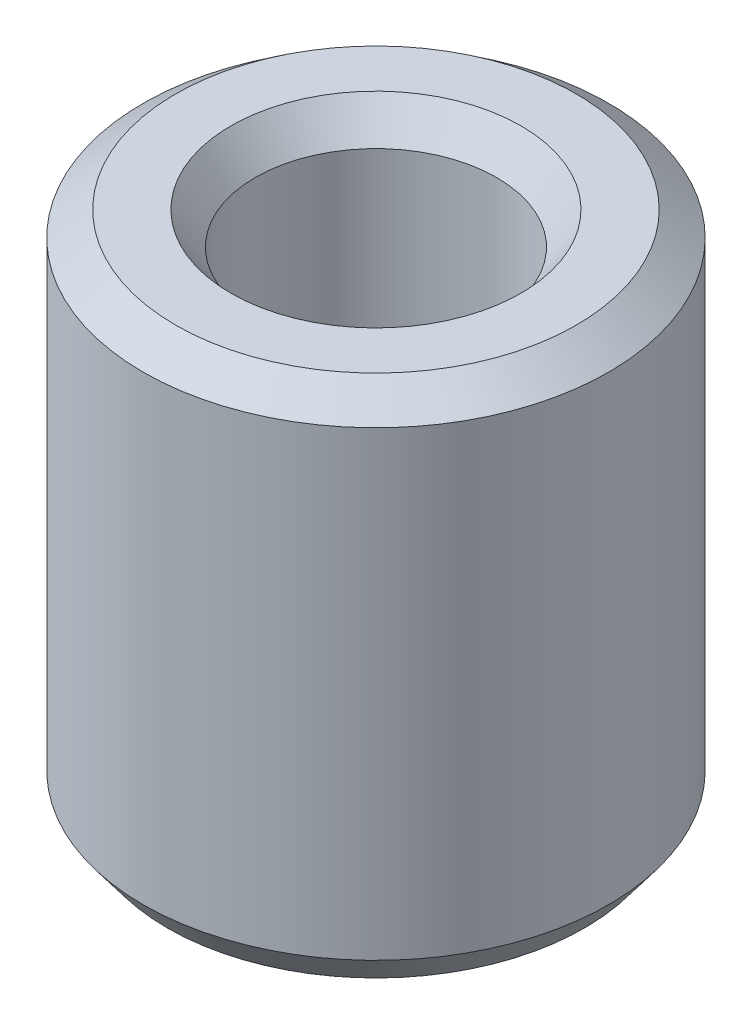
ISO-10303-21;
HEADER;
FILE_DESCRIPTION(('STEP AP214'),'2;1');
FILE_NAME('part.step','',(''),(''),'','','');
FILE_SCHEMA(('AUTOMOTIVE_DESIGN { 1 0 10303 214 1 1 1 1 }'));
ENDSEC;
DATA;
#1=APPLICATION_CONTEXT('core data for automotive mechanical design processes');
#2=APPLICATION_PROTOCOL_DEFINITION('international standard','automotive_design',2000,#1);
#3=PRODUCT_CONTEXT('',#1,'mechanical');
#4=PRODUCT('Part','Part','',(#3));
#5=PRODUCT_RELATED_PRODUCT_CATEGORY('part','',(#4));
#6=PRODUCT_DEFINITION_FORMATION('','',#4);
#7=PRODUCT_DEFINITION_CONTEXT('part definition',#1,'design');
#8=PRODUCT_DEFINITION('design','',#6,#7);
#9=PRODUCT_DEFINITION_SHAPE('','',#8);
#10=(LENGTH_UNIT() NAMED_UNIT(*) SI_UNIT(.MILLI.,.METRE.));
#11=(NAMED_UNIT(*) PLANE_ANGLE_UNIT() SI_UNIT($,.RADIAN.));
#12=(NAMED_UNIT(*) SI_UNIT($,.STERADIAN.) SOLID_ANGLE_UNIT());
#13=UNCERTAINTY_MEASURE_WITH_UNIT(LENGTH_MEASURE(1.E-05),#10,'distance_accuracy_value','');
#14=(GEOMETRIC_REPRESENTATION_CONTEXT(3) GLOBAL_UNCERTAINTY_ASSIGNED_CONTEXT((#13)) GLOBAL_UNIT_ASSIGNED_CONTEXT((#10,
#11,#12)) REPRESENTATION_CONTEXT('',''));
#15=CARTESIAN_POINT('',(0.,0.,0.));
#16=DIRECTION('',(0.,0.,1.));
#17=DIRECTION('',(1.,0.,0.));
#18=AXIS2_PLACEMENT_3D('',#15,#16,#17);
#19=CARTESIAN_POINT('',(0.,11.1277565931135,0.));
#20=DIRECTION('',(0.,-1.,0.));
#21=DIRECTION('',(0.,0.,-1.));
#22=AXIS2_PLACEMENT_3D('',#19,#20,#21);
#23=CYLINDRICAL_SURFACE('',#22,5.);
#24=CARTESIAN_POINT('',(0.,0.698186209261358,0.));
#25=DIRECTION('',(0.,1.,0.));
#26=DIRECTION('',(0.,0.,1.));
#27=AXIS2_PLACEMENT_3D('',#24,#25,#26);
#28=CIRCLE('',#27,5.);
#29=CARTESIAN_POINT('',(0.,0.698186209261358,5.));
#30=VERTEX_POINT('',#29);
#31=EDGE_CURVE('E10',#30,#30,#28,.T.);
#32=ORIENTED_EDGE('',*,*,#31,.T.);
#33=EDGE_LOOP('',(#32));
#34=FACE_BOUND('',#33,.T.);
#35=CARTESIAN_POINT('',(0.,10.6038862192034,0.));
#36=DIRECTION('',(0.,1.,0.));
#37=DIRECTION('',(0.,0.,1.));
#38=AXIS2_PLACEMENT_3D('',#35,#36,#37);
#39=CIRCLE('',#38,5.);
#40=CARTESIAN_POINT('',(0.,10.6038862192034,5.));
#41=VERTEX_POINT('',#40);
#42=EDGE_CURVE('E50',#41,#41,#39,.F.);
#43=ORIENTED_EDGE('',*,*,#42,.T.);
#44=EDGE_LOOP('',(#43));
#45=FACE_BOUND('',#44,.T.);
#46=ADVANCED_FACE('F39',(#34,#45),#23,.T.);
#47=CARTESIAN_POINT('',(0.,11.1277565931135,0.));
#48=DIRECTION('',(0.,1.,0.));
#49=DIRECTION('',(0.,0.,1.));
#50=AXIS2_PLACEMENT_3D('',#47,#48,#49);
#51=PLANE('',#50);
#52=CARTESIAN_POINT('',(0.,11.1277565931135,0.));
#53=DIRECTION('',(0.,1.,0.));
#54=DIRECTION('',(0.,0.,1.));
#55=AXIS2_PLACEMENT_3D('',#52,#53,#54);
#56=CIRCLE('',#55,3.11444026431996);
#57=CARTESIAN_POINT('',(0.,11.1277565931135,3.11444026431996));
#58=VERTEX_POINT('',#57);
#59=EDGE_CURVE('E58',#58,#58,#56,.F.);
#60=ORIENTED_EDGE('',*,*,#59,.T.);
#61=EDGE_LOOP('',(#60));
#62=FACE_BOUND('',#61,.T.);
#63=CARTESIAN_POINT('',(0.,11.1277565931135,0.));
#64=DIRECTION('',(0.,1.,0.));
#65=DIRECTION('',(0.,0.,1.));
#66=AXIS2_PLACEMENT_3D('',#63,#64,#65);
#67=CIRCLE('',#66,4.30181379073864);
#68=CARTESIAN_POINT('',(0.,11.1277565931135,4.30181379073864));
#69=VERTEX_POINT('',#68);
#70=EDGE_CURVE('E61',#69,#69,#67,.T.);
#71=ORIENTED_EDGE('',*,*,#70,.T.);
#72=EDGE_LOOP('',(#71));
#73=FACE_BOUND('',#72,.T.);
#74=ADVANCED_FACE('F88',(#62,#73),#51,.T.);
#75=CARTESIAN_POINT('',(0.,0.,0.));
#76=DIRECTION('',(0.,1.,0.));
#77=DIRECTION('',(0.,0.,1.));
#78=AXIS2_PLACEMENT_3D('',#75,#76,#77);
#79=PLANE('',#78);
#80=CARTESIAN_POINT('',(0.,0.,0.));
#81=DIRECTION('',(0.,1.,0.));
#82=DIRECTION('',(0.,0.,1.));
#83=AXIS2_PLACEMENT_3D('',#80,#81,#82);
#84=CIRCLE('',#83,3.28875609967118);
#85=CARTESIAN_POINT('',(0.,0.,3.28875609967118));
#86=VERTEX_POINT('',#85);
#87=EDGE_CURVE('E51',#86,#86,#84,.T.);
#88=ORIENTED_EDGE('',*,*,#87,.T.);
#89=EDGE_LOOP('',(#88));
#90=FACE_BOUND('',#89,.T.);
#91=CARTESIAN_POINT('',(0.,0.,0.));
#92=DIRECTION('',(0.,1.,0.));
#93=DIRECTION('',(0.,0.,1.));
#94=AXIS2_PLACEMENT_3D('',#91,#92,#93);
#95=CIRCLE('',#94,4.47612962608987);
#96=CARTESIAN_POINT('',(0.,0.,4.47612962608987));
#97=VERTEX_POINT('',#96);
#98=EDGE_CURVE('E54',#97,#97,#95,.F.);
#99=ORIENTED_EDGE('',*,*,#98,.T.);
#100=EDGE_LOOP('',(#99));
#101=FACE_BOUND('',#100,.T.);
#102=ADVANCED_FACE('F83',(#90,#101),#79,.F.);
#103=CARTESIAN_POINT('',(0.,11.1277565931135,0.));
#104=DIRECTION('',(0.,-1.,0.));
#105=DIRECTION('',(0.,0.,-1.));
#106=AXIS2_PLACEMENT_3D('',#103,#104,#105);
#107=CYLINDRICAL_SURFACE('',#106,2.59056989040983);
#108=CARTESIAN_POINT('',(0.,10.4295703838521,0.));
#109=DIRECTION('',(0.,1.,0.));
#110=DIRECTION('',(0.,0.,1.));
#111=AXIS2_PLACEMENT_3D('',#108,#109,#110);
#112=CIRCLE('',#111,2.59056989040983);
#113=CARTESIAN_POINT('',(0.,10.4295703838521,2.59056989040983));
#114=VERTEX_POINT('',#113);
#115=EDGE_CURVE('E67',#114,#114,#112,.T.);
#116=ORIENTED_EDGE('',*,*,#115,.T.);
#117=EDGE_LOOP('',(#116));
#118=FACE_BOUND('',#117,.T.);
#119=CARTESIAN_POINT('',(0.,0.523870373910131,0.));
#120=DIRECTION('',(0.,1.,0.));
#121=DIRECTION('',(0.,0.,1.));
#122=AXIS2_PLACEMENT_3D('',#119,#120,#121);
#123=CIRCLE('',#122,2.59056989040983);
#124=CARTESIAN_POINT('',(0.,0.523870373910131,2.59056989040983));
#125=VERTEX_POINT('',#124);
#126=EDGE_CURVE('E69',#125,#125,#123,.F.);
#127=ORIENTED_EDGE('',*,*,#126,.T.);
#128=EDGE_LOOP('',(#127));
#129=FACE_BOUND('',#128,.T.);
#130=ADVANCED_FACE('F71',(#118,#129),#107,.F.);
#131=CARTESIAN_POINT('',(0.,10.4295703838521,0.));
#132=DIRECTION('',(0.,1.,0.));
#133=DIRECTION('',(0.,0.,1.));
#134=AXIS2_PLACEMENT_3D('',#131,#132,#133);
#135=CONICAL_SURFACE('',#134,2.59056989040983,0.643712564470003);
#136=CARTESIAN_POINT('',(0.,11.1277565931135,3.11444026431996));
#137=CARTESIAN_POINT('',(0.,11.1204838201003,3.1089832812584));
#138=CARTESIAN_POINT('',(0.,11.1132110470872,3.10352629819683));
#139=CARTESIAN_POINT('',(0.,11.0986655010609,3.09261233207371));
#140=CARTESIAN_POINT('',(0.,11.0913927280478,3.08715534901214));
#141=CARTESIAN_POINT('',(0.,11.0768471820215,3.07624138288902));
#142=CARTESIAN_POINT('',(0.,11.0695744090084,3.07078439982745));
#143=CARTESIAN_POINT('',(0.,11.0550288629821,3.05987043370432));
#144=CARTESIAN_POINT('',(0.,11.047756089969,3.05441345064276));
#145=CARTESIAN_POINT('',(0.,11.0332105439427,3.04349948451963));
#146=CARTESIAN_POINT('',(0.,11.0259377709295,3.03804250145807));
#147=CARTESIAN_POINT('',(0.,11.0113922249033,3.02712853533494));
#148=CARTESIAN_POINT('',(0.,11.0041194518901,3.02167155227338));
#149=CARTESIAN_POINT('',(0.,10.9895739058638,3.01075758615025));
#150=CARTESIAN_POINT('',(0.,10.9823011328507,3.00530060308868));
#151=CARTESIAN_POINT('',(0.,10.9677555868244,2.99438663696556));
#152=CARTESIAN_POINT('',(0.,10.9604828138113,2.98892965390399));
#153=CARTESIAN_POINT('',(0.,10.945937267785,2.97801568778086));
#154=CARTESIAN_POINT('',(0.,10.9386644947719,2.9725587047193));
#155=CARTESIAN_POINT('',(0.,10.9241189487456,2.96164473859617));
#156=CARTESIAN_POINT('',(0.,10.9168461757324,2.95618775553461));
#157=CARTESIAN_POINT('',(0.,10.9023006297062,2.94527378941148));
#158=CARTESIAN_POINT('',(0.,10.895027856693,2.93981680634992));
#159=CARTESIAN_POINT('',(0.,10.8804823106668,2.92890284022679));
#160=CARTESIAN_POINT('',(0.,10.8732095376536,2.92344585716523));
#161=CARTESIAN_POINT('',(0.,10.8586639916273,2.9125318910421));
#162=CARTESIAN_POINT('',(0.,10.8513912186142,2.90707490798053));
#163=CARTESIAN_POINT('',(0.,10.8368456725879,2.89616094185741));
#164=CARTESIAN_POINT('',(0.,10.8295728995748,2.89070395879584));
#165=CARTESIAN_POINT('',(0.,10.8150273535485,2.87978999267272));
#166=CARTESIAN_POINT('',(0.,10.8077545805354,2.87433300961115));
#167=CARTESIAN_POINT('',(0.,10.7932090345091,2.86341904348802));
#168=CARTESIAN_POINT('',(0.,10.7859362614959,2.85796206042646));
#169=CARTESIAN_POINT('',(0.,10.7713907154697,2.84704809430333));
#170=CARTESIAN_POINT('',(0.,10.7641179424565,2.84159111124177));
#171=CARTESIAN_POINT('',(0.,10.7495723964302,2.83067714511864));
#172=CARTESIAN_POINT('',(0.,10.7422996234171,2.82522016205708));
#173=CARTESIAN_POINT('',(0.,10.7277540773908,2.81430619593395));
#174=CARTESIAN_POINT('',(0.,10.7204813043777,2.80884921287238));
#175=CARTESIAN_POINT('',(0.,10.7059357583514,2.79793524674926));
#176=CARTESIAN_POINT('',(0.,10.6986629853383,2.79247826368769));
#177=CARTESIAN_POINT('',(0.,10.684117439312,2.78156429756456));
#178=CARTESIAN_POINT('',(0.,10.6768446662989,2.776107314503));
#179=CARTESIAN_POINT('',(0.,10.6622991202726,2.76519334837987));
#180=CARTESIAN_POINT('',(0.,10.6550263472594,2.75973636531831));
#181=CARTESIAN_POINT('',(0.,10.6404808012332,2.74882239919518));
#182=CARTESIAN_POINT('',(0.,10.63320802822,2.74336541613362));
#183=CARTESIAN_POINT('',(0.,10.6186624821937,2.73245145001049));
#184=CARTESIAN_POINT('',(0.,10.6113897091806,2.72699446694893));
#185=CARTESIAN_POINT('',(0.,10.5968441631543,2.7160805008258));
#186=CARTESIAN_POINT('',(0.,10.5895713901412,2.71062351776423));
#187=CARTESIAN_POINT('',(0.,10.5750258441149,2.69970955164111));
#188=CARTESIAN_POINT('',(0.,10.5677530711018,2.69425256857954));
#189=CARTESIAN_POINT('',(0.,10.5532075250755,2.68333860245641));
#190=CARTESIAN_POINT('',(0.,10.5459347520623,2.67788161939485));
#191=CARTESIAN_POINT('',(0.,10.5313892060361,2.66696765327172));
#192=CARTESIAN_POINT('',(0.,10.5241164330229,2.66151067021016));
#193=CARTESIAN_POINT('',(0.,10.5095708869967,2.65059670408703));
#194=CARTESIAN_POINT('',(0.,10.5022981139835,2.64513972102547));
#195=CARTESIAN_POINT('',(0.,10.4877525679572,2.63422575490234));
#196=CARTESIAN_POINT('',(0.,10.4804797949441,2.62876877184077));
#197=CARTESIAN_POINT('',(0.,10.4659342489178,2.61785480571765));
#198=CARTESIAN_POINT('',(0.,10.4586614759047,2.61239782265608));
#199=CARTESIAN_POINT('',(0.,10.4441159298784,2.60148385653296));
#200=CARTESIAN_POINT('',(0.,10.4368431568653,2.59602687347139));
#201=CARTESIAN_POINT('',(0.,10.4295703838521,2.59056989040983));
#202=B_SPLINE_CURVE_WITH_KNOTS('',3,(#136,#137,#138,#139,#140,#141,#142,#143,#144,#145,#146,
#147,#148,#149,#150,#151,#152,#153,#154,#155,#156,#157,#158,#159,#160,#161,#162,#163,#164,#165,
#166,#167,#168,#169,#170,#171,#172,#173,#174,#175,#176,#177,#178,#179,#180,#181,#182,#183,#184,
#185,#186,#187,#188,#189,#190,#191,#192,#193,#194,#195,#196,#197,#198,#199,#200,#201),
.UNSPECIFIED.,.F.,.F.,(4,2,2,2,2,2,2,2,2,2,2,2,2,2,2,2,2,2,2,2,2,2,2,2,2,2,2,2,2,2,2,2,4),(0.,
0.0272772253521782,0.0545544507043577,0.081831676056537,0.109108901408715,0.136386126760895,
0.163663352113074,0.190940577465254,0.218217802817432,0.245495028169612,0.272772253521791,
0.300049478873969,0.327326704226149,0.354603929578328,0.381881154930508,0.409158380282686,
0.436435605634866,0.463712830987045,0.490990056339223,0.518267281691403,0.545544507043583,
0.572821732395762,0.60009895774794,0.62737618310012,0.654653408452299,0.681930633804479,
0.709207859156657,0.736485084508837,0.763762309861016,0.791039535213194,0.818316760565374,
0.845593985917553,0.872871211269732),.UNSPECIFIED.);
#203=EDGE_CURVE('BSEAM77',#58,#114,#202,.T.);
#204=ORIENTED_EDGE('',*,*,#59,.F.);
#205=ORIENTED_EDGE('',*,*,#115,.F.);
#206=ORIENTED_EDGE('',*,*,#203,.T.);
#207=ORIENTED_EDGE('',*,*,#203,.F.);
#208=EDGE_LOOP('',(#204,#206,#205,#207));
#209=FACE_BOUND('',#208,.T.);
#210=ADVANCED_FACE('F77',(#209),#135,.F.);
#211=CARTESIAN_POINT('',(0.,0.,0.));
#212=DIRECTION('',(0.,-1.,0.));
#213=DIRECTION('',(0.,0.,-1.));
#214=AXIS2_PLACEMENT_3D('',#211,#212,#213);
#215=CONICAL_SURFACE('',#214,3.28875609967118,0.927083762324893);
#216=ORIENTED_EDGE('',*,*,#126,.F.);
#217=EDGE_LOOP('',(#216));
#218=FACE_BOUND('',#217,.T.);
#219=ORIENTED_EDGE('',*,*,#87,.F.);
#220=EDGE_LOOP('',(#219));
#221=FACE_BOUND('',#220,.T.);
#222=ADVANCED_FACE('F73',(#218,#221),#215,.F.);
#223=CARTESIAN_POINT('',(0.,0.698186209261358,0.));
#224=DIRECTION('',(0.,1.,0.));
#225=DIRECTION('',(0.,0.,1.));
#226=AXIS2_PLACEMENT_3D('',#223,#224,#225);
#227=CONICAL_SURFACE('',#226,5.,0.643712564470004);
#228=ORIENTED_EDGE('',*,*,#98,.F.);
#229=EDGE_LOOP('',(#228));
#230=FACE_BOUND('',#229,.T.);
#231=ORIENTED_EDGE('',*,*,#31,.F.);
#232=EDGE_LOOP('',(#231));
#233=FACE_BOUND('',#232,.T.);
#234=ADVANCED_FACE('F76',(#230,#233),#227,.T.);
#235=CARTESIAN_POINT('',(0.,11.1277565931135,0.));
#236=DIRECTION('',(0.,-1.,0.));
#237=DIRECTION('',(0.,0.,-1.));
#238=AXIS2_PLACEMENT_3D('',#235,#236,#237);
#239=CONICAL_SURFACE('',#238,4.30181379073864,0.927083762324893);
#240=ORIENTED_EDGE('',*,*,#42,.F.);
#241=EDGE_LOOP('',(#240));
#242=FACE_BOUND('',#241,.T.);
#243=ORIENTED_EDGE('',*,*,#70,.F.);
#244=EDGE_LOOP('',(#243));
#245=FACE_BOUND('',#244,.T.);
#246=ADVANCED_FACE('F45',(#242,#245),#239,.T.);
#247=CLOSED_SHELL('',(#46,#74,#102,#130,#210,#222,#234,#246));
#248=MANIFOLD_SOLID_BREP('B2',#247);
#249=ADVANCED_BREP_SHAPE_REPRESENTATION('',(#18,#248),#14);
#250=SHAPE_DEFINITION_REPRESENTATION(#9,#249);
ENDSEC;
END-ISO-10303-21;
